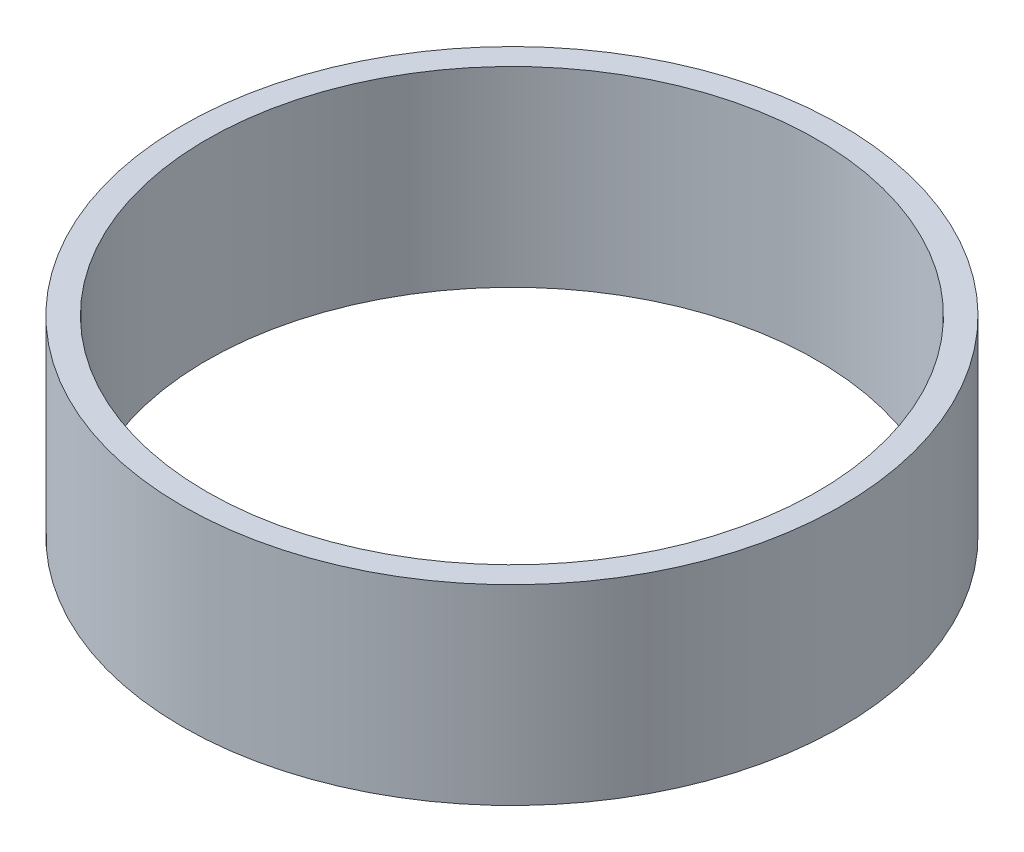
ISO-10303-21;
HEADER;
FILE_DESCRIPTION(('STEP AP214'),'2;1');
FILE_NAME('part.step','',(''),(''),'','','');
FILE_SCHEMA(('AUTOMOTIVE_DESIGN { 1 0 10303 214 1 1 1 1 }'));
ENDSEC;
DATA;
#1=APPLICATION_CONTEXT('core data for automotive mechanical design processes');
#2=APPLICATION_PROTOCOL_DEFINITION('international standard','automotive_design',2000,#1);
#3=PRODUCT_CONTEXT('',#1,'mechanical');
#4=PRODUCT('Part','Part','',(#3));
#5=PRODUCT_RELATED_PRODUCT_CATEGORY('part','',(#4));
#6=PRODUCT_DEFINITION_FORMATION('','',#4);
#7=PRODUCT_DEFINITION_CONTEXT('part definition',#1,'design');
#8=PRODUCT_DEFINITION('design','',#6,#7);
#9=PRODUCT_DEFINITION_SHAPE('','',#8);
#10=(LENGTH_UNIT() NAMED_UNIT(*) SI_UNIT(.MILLI.,.METRE.));
#11=(NAMED_UNIT(*) PLANE_ANGLE_UNIT() SI_UNIT($,.RADIAN.));
#12=(NAMED_UNIT(*) SI_UNIT($,.STERADIAN.) SOLID_ANGLE_UNIT());
#13=UNCERTAINTY_MEASURE_WITH_UNIT(LENGTH_MEASURE(1.E-05),#10,'distance_accuracy_value','');
#14=(GEOMETRIC_REPRESENTATION_CONTEXT(3) GLOBAL_UNCERTAINTY_ASSIGNED_CONTEXT((#13)) GLOBAL_UNIT_ASSIGNED_CONTEXT((#10,
#11,#12)) REPRESENTATION_CONTEXT('',''));
#15=CARTESIAN_POINT('',(0.,0.,0.));
#16=DIRECTION('',(0.,0.,1.));
#17=DIRECTION('',(1.,0.,0.));
#18=AXIS2_PLACEMENT_3D('',#15,#16,#17);
#19=CARTESIAN_POINT('',(0.,23.5,0.));
#20=DIRECTION('',(0.,1.,0.));
#21=DIRECTION('',(0.,0.,1.));
#22=AXIS2_PLACEMENT_3D('',#19,#20,#21);
#23=PLANE('',#22);
#24=CARTESIAN_POINT('',(0.,23.5,0.));
#25=DIRECTION('',(0.,1.,0.));
#26=DIRECTION('',(0.,0.,1.));
#27=AXIS2_PLACEMENT_3D('',#24,#25,#26);
#28=CIRCLE('',#27,40.5);
#29=CARTESIAN_POINT('',(0.,23.5,40.5));
#30=VERTEX_POINT('',#29);
#31=EDGE_CURVE('E10',#30,#30,#28,.T.);
#32=ORIENTED_EDGE('',*,*,#31,.T.);
#33=EDGE_LOOP('',(#32));
#34=FACE_BOUND('',#33,.T.);
#35=CARTESIAN_POINT('',(0.,23.5,0.));
#36=DIRECTION('',(0.,1.,0.));
#37=DIRECTION('',(0.,0.,1.));
#38=AXIS2_PLACEMENT_3D('',#35,#36,#37);
#39=CIRCLE('',#38,37.5);
#40=CARTESIAN_POINT('',(0.,23.5,37.5));
#41=VERTEX_POINT('',#40);
#42=EDGE_CURVE('E42',#41,#41,#39,.T.);
#43=ORIENTED_EDGE('',*,*,#42,.F.);
#44=EDGE_LOOP('',(#43));
#45=FACE_BOUND('',#44,.T.);
#46=ADVANCED_FACE('F31',(#34,#45),#23,.T.);
#47=CARTESIAN_POINT('',(0.,0.,0.));
#48=DIRECTION('',(0.,1.,0.));
#49=DIRECTION('',(0.,0.,1.));
#50=AXIS2_PLACEMENT_3D('',#47,#48,#49);
#51=PLANE('',#50);
#52=CARTESIAN_POINT('',(0.,0.,0.));
#53=DIRECTION('',(0.,1.,0.));
#54=DIRECTION('',(0.,0.,1.));
#55=AXIS2_PLACEMENT_3D('',#52,#53,#54);
#56=CIRCLE('',#55,40.5);
#57=CARTESIAN_POINT('',(0.,0.,40.5));
#58=VERTEX_POINT('',#57);
#59=EDGE_CURVE('E35',#58,#58,#56,.T.);
#60=ORIENTED_EDGE('',*,*,#59,.F.);
#61=EDGE_LOOP('',(#60));
#62=FACE_BOUND('',#61,.T.);
#63=CARTESIAN_POINT('',(0.,0.,0.));
#64=DIRECTION('',(0.,1.,0.));
#65=DIRECTION('',(0.,0.,1.));
#66=AXIS2_PLACEMENT_3D('',#63,#64,#65);
#67=CIRCLE('',#66,37.5);
#68=CARTESIAN_POINT('',(0.,0.,37.5));
#69=VERTEX_POINT('',#68);
#70=EDGE_CURVE('E44',#69,#69,#67,.T.);
#71=ORIENTED_EDGE('',*,*,#70,.T.);
#72=EDGE_LOOP('',(#71));
#73=FACE_BOUND('',#72,.T.);
#74=ADVANCED_FACE('F54',(#62,#73),#51,.F.);
#75=CARTESIAN_POINT('',(0.,23.5,0.));
#76=DIRECTION('',(0.,-1.,0.));
#77=DIRECTION('',(0.,0.,-1.));
#78=AXIS2_PLACEMENT_3D('',#75,#76,#77);
#79=CYLINDRICAL_SURFACE('',#78,40.5);
#80=ORIENTED_EDGE('',*,*,#31,.F.);
#81=EDGE_LOOP('',(#80));
#82=FACE_BOUND('',#81,.T.);
#83=ORIENTED_EDGE('',*,*,#59,.T.);
#84=EDGE_LOOP('',(#83));
#85=FACE_BOUND('',#84,.T.);
#86=ADVANCED_FACE('F33',(#82,#85),#79,.T.);
#87=CARTESIAN_POINT('',(0.,23.5,0.));
#88=DIRECTION('',(0.,-1.,0.));
#89=DIRECTION('',(0.,0.,-1.));
#90=AXIS2_PLACEMENT_3D('',#87,#88,#89);
#91=CYLINDRICAL_SURFACE('',#90,37.5);
#92=ORIENTED_EDGE('',*,*,#42,.T.);
#93=EDGE_LOOP('',(#92));
#94=FACE_BOUND('',#93,.T.);
#95=ORIENTED_EDGE('',*,*,#70,.F.);
#96=EDGE_LOOP('',(#95));
#97=FACE_BOUND('',#96,.T.);
#98=ADVANCED_FACE('F50',(#94,#97),#91,.F.);
#99=CLOSED_SHELL('',(#46,#74,#86,#98));
#100=MANIFOLD_SOLID_BREP('B2',#99);
#101=ADVANCED_BREP_SHAPE_REPRESENTATION('',(#18,#100),#14);
#102=SHAPE_DEFINITION_REPRESENTATION(#9,#101);
ENDSEC;
END-ISO-10303-21;
